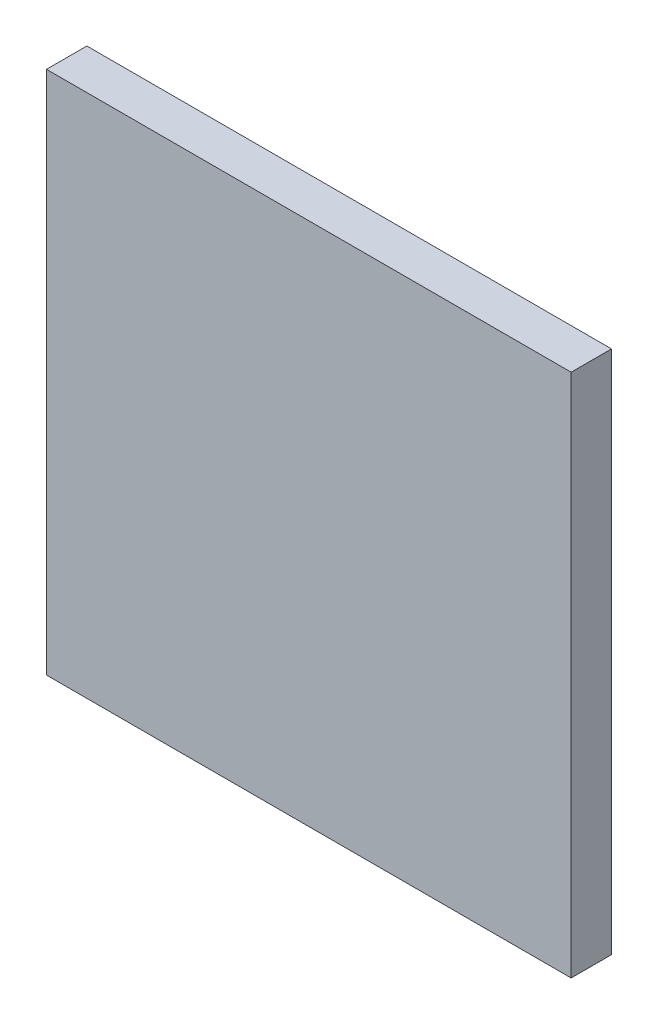
ISO-10303-21;
HEADER;
FILE_DESCRIPTION(('STEP AP214'),'2;1');
FILE_NAME('part.step','',(''),(''),'','','');
FILE_SCHEMA(('AUTOMOTIVE_DESIGN { 1 0 10303 214 1 1 1 1 }'));
ENDSEC;
DATA;
#1=APPLICATION_CONTEXT('core data for automotive mechanical design processes');
#2=APPLICATION_PROTOCOL_DEFINITION('international standard','automotive_design',2000,#1);
#3=PRODUCT_CONTEXT('',#1,'mechanical');
#4=PRODUCT('Part','Part','',(#3));
#5=PRODUCT_RELATED_PRODUCT_CATEGORY('part','',(#4));
#6=PRODUCT_DEFINITION_FORMATION('','',#4);
#7=PRODUCT_DEFINITION_CONTEXT('part definition',#1,'design');
#8=PRODUCT_DEFINITION('design','',#6,#7);
#9=PRODUCT_DEFINITION_SHAPE('','',#8);
#10=(LENGTH_UNIT() NAMED_UNIT(*) SI_UNIT(.MILLI.,.METRE.));
#11=(NAMED_UNIT(*) PLANE_ANGLE_UNIT() SI_UNIT($,.RADIAN.));
#12=(NAMED_UNIT(*) SI_UNIT($,.STERADIAN.) SOLID_ANGLE_UNIT());
#13=UNCERTAINTY_MEASURE_WITH_UNIT(LENGTH_MEASURE(1.E-05),#10,'distance_accuracy_value','');
#14=(GEOMETRIC_REPRESENTATION_CONTEXT(3) GLOBAL_UNCERTAINTY_ASSIGNED_CONTEXT((#13)) GLOBAL_UNIT_ASSIGNED_CONTEXT((#10,
#11,#12)) REPRESENTATION_CONTEXT('',''));
#15=CARTESIAN_POINT('',(0.,0.,0.));
#16=DIRECTION('',(0.,0.,1.));
#17=DIRECTION('',(1.,0.,0.));
#18=AXIS2_PLACEMENT_3D('',#15,#16,#17);
#19=CARTESIAN_POINT('',(-65.,-65.,10.));
#20=DIRECTION('',(1.,0.,0.));
#21=DIRECTION('',(0.,0.,-1.));
#22=AXIS2_PLACEMENT_3D('',#19,#20,#21);
#23=PLANE('',#22);
#24=DIRECTION('',(0.,-1.,0.));
#25=VECTOR('',#24,1.);
#26=CARTESIAN_POINT('',(-65.,-65.,0.));
#27=LINE('',#26,#25);
#28=CARTESIAN_POINT('',(-65.,65.,0.));
#29=VERTEX_POINT('',#28);
#30=CARTESIAN_POINT('',(-65.,-65.,0.));
#31=VERTEX_POINT('',#30);
#32=EDGE_CURVE('E106',#29,#31,#27,.T.);
#33=ORIENTED_EDGE('',*,*,#32,.T.);
#34=DIRECTION('',(0.,0.,-1.));
#35=VECTOR('',#34,1.);
#36=CARTESIAN_POINT('',(-65.,-65.,10.));
#37=LINE('',#36,#35);
#38=CARTESIAN_POINT('',(-65.,-65.,10.));
#39=VERTEX_POINT('',#38);
#40=EDGE_CURVE('E11',#39,#31,#37,.T.);
#41=ORIENTED_EDGE('',*,*,#40,.F.);
#42=DIRECTION('',(0.,-1.,0.));
#43=VECTOR('',#42,1.);
#44=CARTESIAN_POINT('',(-65.,-65.,10.));
#45=LINE('',#44,#43);
#46=CARTESIAN_POINT('',(-65.,65.,10.));
#47=VERTEX_POINT('',#46);
#48=EDGE_CURVE('E89',#47,#39,#45,.T.);
#49=ORIENTED_EDGE('',*,*,#48,.F.);
#50=DIRECTION('',(0.,0.,-1.));
#51=VECTOR('',#50,1.);
#52=CARTESIAN_POINT('',(-65.,65.,10.));
#53=LINE('',#52,#51);
#54=EDGE_CURVE('E102',#47,#29,#53,.T.);
#55=ORIENTED_EDGE('',*,*,#54,.T.);
#56=EDGE_LOOP('',(#33,#41,#49,#55));
#57=FACE_BOUND('',#56,.T.);
#58=ADVANCED_FACE('F37',(#57),#23,.F.);
#59=CARTESIAN_POINT('',(65.,-65.,10.));
#60=DIRECTION('',(0.,1.,0.));
#61=DIRECTION('',(-1.,0.,0.));
#62=AXIS2_PLACEMENT_3D('',#59,#60,#61);
#63=PLANE('',#62);
#64=DIRECTION('',(1.,0.,0.));
#65=VECTOR('',#64,1.);
#66=CARTESIAN_POINT('',(65.,-65.,0.));
#67=LINE('',#66,#65);
#68=CARTESIAN_POINT('',(65.,-65.,0.));
#69=VERTEX_POINT('',#68);
#70=EDGE_CURVE('E94',#31,#69,#67,.T.);
#71=ORIENTED_EDGE('',*,*,#70,.T.);
#72=DIRECTION('',(0.,0.,-1.));
#73=VECTOR('',#72,1.);
#74=CARTESIAN_POINT('',(65.,-65.,10.));
#75=LINE('',#74,#73);
#76=CARTESIAN_POINT('',(65.,-65.,10.));
#77=VERTEX_POINT('',#76);
#78=EDGE_CURVE('E46',#77,#69,#75,.T.);
#79=ORIENTED_EDGE('',*,*,#78,.F.);
#80=DIRECTION('',(1.,0.,0.));
#81=VECTOR('',#80,1.);
#82=CARTESIAN_POINT('',(65.,-65.,10.));
#83=LINE('',#82,#81);
#84=EDGE_CURVE('E84',#39,#77,#83,.T.);
#85=ORIENTED_EDGE('',*,*,#84,.F.);
#86=ORIENTED_EDGE('',*,*,#40,.T.);
#87=EDGE_LOOP('',(#71,#79,#85,#86));
#88=FACE_BOUND('',#87,.T.);
#89=ADVANCED_FACE('F93',(#88),#63,.F.);
#90=CARTESIAN_POINT('',(65.,-65.,10.));
#91=DIRECTION('',(-1.,0.,0.));
#92=DIRECTION('',(0.,0.,1.));
#93=AXIS2_PLACEMENT_3D('',#90,#91,#92);
#94=PLANE('',#93);
#95=DIRECTION('',(0.,1.,0.));
#96=VECTOR('',#95,1.);
#97=CARTESIAN_POINT('',(65.,-65.,0.));
#98=LINE('',#97,#96);
#99=CARTESIAN_POINT('',(65.,65.,0.));
#100=VERTEX_POINT('',#99);
#101=EDGE_CURVE('E71',#69,#100,#98,.T.);
#102=ORIENTED_EDGE('',*,*,#101,.T.);
#103=DIRECTION('',(0.,0.,-1.));
#104=VECTOR('',#103,1.);
#105=CARTESIAN_POINT('',(65.,65.,10.));
#106=LINE('',#105,#104);
#107=CARTESIAN_POINT('',(65.,65.,10.));
#108=VERTEX_POINT('',#107);
#109=EDGE_CURVE('E96',#108,#100,#106,.T.);
#110=ORIENTED_EDGE('',*,*,#109,.F.);
#111=DIRECTION('',(0.,1.,0.));
#112=VECTOR('',#111,1.);
#113=CARTESIAN_POINT('',(65.,-65.,10.));
#114=LINE('',#113,#112);
#115=EDGE_CURVE('E87',#77,#108,#114,.T.);
#116=ORIENTED_EDGE('',*,*,#115,.F.);
#117=ORIENTED_EDGE('',*,*,#78,.T.);
#118=EDGE_LOOP('',(#102,#110,#116,#117));
#119=FACE_BOUND('',#118,.T.);
#120=ADVANCED_FACE('F97',(#119),#94,.F.);
#121=CARTESIAN_POINT('',(65.,65.,10.));
#122=DIRECTION('',(0.,-1.,0.));
#123=DIRECTION('',(1.,0.,0.));
#124=AXIS2_PLACEMENT_3D('',#121,#122,#123);
#125=PLANE('',#124);
#126=DIRECTION('',(-1.,0.,0.));
#127=VECTOR('',#126,1.);
#128=CARTESIAN_POINT('',(65.,65.,0.));
#129=LINE('',#128,#127);
#130=EDGE_CURVE('E77',#100,#29,#129,.T.);
#131=ORIENTED_EDGE('',*,*,#130,.T.);
#132=ORIENTED_EDGE('',*,*,#54,.F.);
#133=DIRECTION('',(-1.,0.,0.));
#134=VECTOR('',#133,1.);
#135=CARTESIAN_POINT('',(65.,65.,10.));
#136=LINE('',#135,#134);
#137=EDGE_CURVE('E54',#108,#47,#136,.T.);
#138=ORIENTED_EDGE('',*,*,#137,.F.);
#139=ORIENTED_EDGE('',*,*,#109,.T.);
#140=EDGE_LOOP('',(#131,#132,#138,#139));
#141=FACE_BOUND('',#140,.T.);
#142=ADVANCED_FACE('F119',(#141),#125,.F.);
#143=CARTESIAN_POINT('',(0.,0.,10.));
#144=DIRECTION('',(0.,0.,1.));
#145=DIRECTION('',(1.,0.,0.));
#146=AXIS2_PLACEMENT_3D('',#143,#144,#145);
#147=PLANE('',#146);
#148=ORIENTED_EDGE('',*,*,#48,.T.);
#149=ORIENTED_EDGE('',*,*,#84,.T.);
#150=ORIENTED_EDGE('',*,*,#115,.T.);
#151=ORIENTED_EDGE('',*,*,#137,.T.);
#152=EDGE_LOOP('',(#148,#149,#150,#151));
#153=FACE_BOUND('',#152,.T.);
#154=ADVANCED_FACE('F85',(#153),#147,.T.);
#155=CARTESIAN_POINT('',(0.,0.,0.));
#156=DIRECTION('',(0.,0.,1.));
#157=DIRECTION('',(1.,0.,0.));
#158=AXIS2_PLACEMENT_3D('',#155,#156,#157);
#159=PLANE('',#158);
#160=ORIENTED_EDGE('',*,*,#32,.F.);
#161=ORIENTED_EDGE('',*,*,#130,.F.);
#162=ORIENTED_EDGE('',*,*,#101,.F.);
#163=ORIENTED_EDGE('',*,*,#70,.F.);
#164=EDGE_LOOP('',(#160,#161,#162,#163));
#165=FACE_BOUND('',#164,.T.);
#166=ADVANCED_FACE('F122',(#165),#159,.F.);
#167=CLOSED_SHELL('',(#58,#89,#120,#142,#154,#166));
#168=MANIFOLD_SOLID_BREP('B2',#167);
#169=ADVANCED_BREP_SHAPE_REPRESENTATION('',(#18,#168),#14);
#170=SHAPE_DEFINITION_REPRESENTATION(#9,#169);
ENDSEC;
END-ISO-10303-21;
